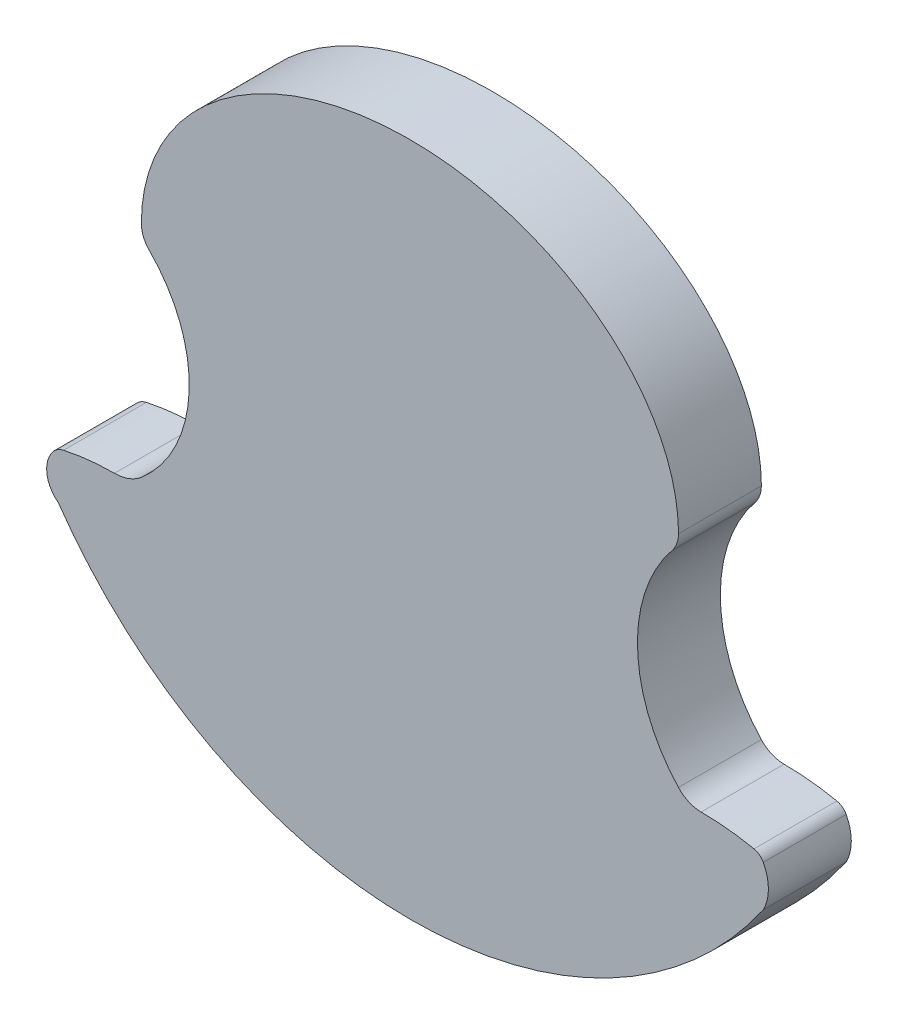
ISO-10303-21;
HEADER;
FILE_DESCRIPTION(('STEP AP214'),'2;1');
FILE_NAME('part.step','',(''),(''),'','','');
FILE_SCHEMA(('AUTOMOTIVE_DESIGN { 1 0 10303 214 1 1 1 1 }'));
ENDSEC;
DATA;
#1=APPLICATION_CONTEXT('core data for automotive mechanical design processes');
#2=APPLICATION_PROTOCOL_DEFINITION('international standard','automotive_design',2000,#1);
#3=PRODUCT_CONTEXT('',#1,'mechanical');
#4=PRODUCT('Part','Part','',(#3));
#5=PRODUCT_RELATED_PRODUCT_CATEGORY('part','',(#4));
#6=PRODUCT_DEFINITION_FORMATION('','',#4);
#7=PRODUCT_DEFINITION_CONTEXT('part definition',#1,'design');
#8=PRODUCT_DEFINITION('design','',#6,#7);
#9=PRODUCT_DEFINITION_SHAPE('','',#8);
#10=(LENGTH_UNIT() NAMED_UNIT(*) SI_UNIT(.MILLI.,.METRE.));
#11=(NAMED_UNIT(*) PLANE_ANGLE_UNIT() SI_UNIT($,.RADIAN.));
#12=(NAMED_UNIT(*) SI_UNIT($,.STERADIAN.) SOLID_ANGLE_UNIT());
#13=UNCERTAINTY_MEASURE_WITH_UNIT(LENGTH_MEASURE(1.E-05),#10,'distance_accuracy_value','');
#14=(GEOMETRIC_REPRESENTATION_CONTEXT(3) GLOBAL_UNCERTAINTY_ASSIGNED_CONTEXT((#13)) GLOBAL_UNIT_ASSIGNED_CONTEXT((#10,
#11,#12)) REPRESENTATION_CONTEXT('',''));
#15=CARTESIAN_POINT('',(0.,0.,0.));
#16=DIRECTION('',(0.,0.,1.));
#17=DIRECTION('',(1.,0.,0.));
#18=AXIS2_PLACEMENT_3D('',#15,#16,#17);
#19=CARTESIAN_POINT('',(-86.2074864245499,146.477908935832,20.));
#20=DIRECTION('',(0.,0.,-1.));
#21=DIRECTION('',(-1.,0.,0.));
#22=AXIS2_PLACEMENT_3D('',#19,#20,#21);
#23=CYLINDRICAL_SURFACE('',#22,32.9795025406708);
#24=CARTESIAN_POINT('',(-86.2074864245499,146.477908935832,0.));
#25=DIRECTION('',(0.,0.,1.));
#26=DIRECTION('',(1.,0.,0.));
#27=AXIS2_PLACEMENT_3D('',#24,#25,#26);
#28=CIRCLE('',#27,32.9795025406708);
#29=CARTESIAN_POINT('',(-62.8874565378825,169.7979388225,0.));
#30=VERTEX_POINT('',#29);
#31=CARTESIAN_POINT('',(-64.7925,121.397120585654,0.));
#32=VERTEX_POINT('',#31);
#33=EDGE_CURVE('E231',#30,#32,#28,.F.);
#34=ORIENTED_EDGE('',*,*,#33,.T.);
#35=DIRECTION('',(0.,0.,-1.));
#36=VECTOR('',#35,1.);
#37=CARTESIAN_POINT('',(-64.7925,121.397120585654,20.));
#38=LINE('',#37,#36);
#39=CARTESIAN_POINT('',(-64.7925,121.397120585654,20.));
#40=VERTEX_POINT('',#39);
#41=EDGE_CURVE('E11',#40,#32,#38,.T.);
#42=ORIENTED_EDGE('',*,*,#41,.F.);
#43=CARTESIAN_POINT('',(-86.2074864245499,146.477908935832,20.));
#44=DIRECTION('',(0.,0.,1.));
#45=DIRECTION('',(1.,0.,0.));
#46=AXIS2_PLACEMENT_3D('',#43,#44,#45);
#47=CIRCLE('',#46,32.9795025406708);
#48=CARTESIAN_POINT('',(-62.8874565378825,169.7979388225,20.));
#49=VERTEX_POINT('',#48);
#50=EDGE_CURVE('E268',#49,#40,#47,.F.);
#51=ORIENTED_EDGE('',*,*,#50,.F.);
#52=DIRECTION('',(0.,0.,-1.));
#53=VECTOR('',#52,1.);
#54=CARTESIAN_POINT('',(-62.8874565378825,169.7979388225,20.));
#55=LINE('',#54,#53);
#56=EDGE_CURVE('E168',#49,#30,#55,.T.);
#57=ORIENTED_EDGE('',*,*,#56,.T.);
#58=EDGE_LOOP('',(#34,#42,#51,#57));
#59=FACE_BOUND('',#58,.T.);
#60=ADVANCED_FACE('F41',(#59),#23,.F.);
#61=CARTESIAN_POINT('',(-71.2859231184699,129.002083186371,20.));
#62=DIRECTION('',(0.,0.,-1.));
#63=DIRECTION('',(-1.,0.,0.));
#64=AXIS2_PLACEMENT_3D('',#61,#62,#63);
#65=CYLINDRICAL_SURFACE('',#64,9.99999999768915);
#66=CARTESIAN_POINT('',(-71.2859231184699,129.002083186371,0.));
#67=DIRECTION('',(0.,0.,1.));
#68=DIRECTION('',(1.,0.,0.));
#69=AXIS2_PLACEMENT_3D('',#66,#67,#68);
#70=CIRCLE('',#69,9.99999999768915);
#71=CARTESIAN_POINT('',(-71.2859231188419,119.002083188681,0.));
#72=VERTEX_POINT('',#71);
#73=EDGE_CURVE('E222',#32,#72,#70,.F.);
#74=ORIENTED_EDGE('',*,*,#73,.T.);
#75=DIRECTION('',(0.,0.,-1.));
#76=VECTOR('',#75,1.);
#77=CARTESIAN_POINT('',(-71.2859231188419,119.002083188681,20.));
#78=LINE('',#77,#76);
#79=CARTESIAN_POINT('',(-71.2859231188419,119.002083188681,20.));
#80=VERTEX_POINT('',#79);
#81=EDGE_CURVE('E49',#80,#72,#78,.T.);
#82=ORIENTED_EDGE('',*,*,#81,.F.);
#83=CARTESIAN_POINT('',(-71.2859231184699,129.002083186371,20.));
#84=DIRECTION('',(0.,0.,1.));
#85=DIRECTION('',(1.,0.,0.));
#86=AXIS2_PLACEMENT_3D('',#83,#84,#85);
#87=CIRCLE('',#86,9.99999999768915);
#88=EDGE_CURVE('E114',#40,#80,#87,.F.);
#89=ORIENTED_EDGE('',*,*,#88,.F.);
#90=ORIENTED_EDGE('',*,*,#41,.T.);
#91=EDGE_LOOP('',(#74,#82,#89,#90));
#92=FACE_BOUND('',#91,.T.);
#93=ADVANCED_FACE('F215',(#92),#65,.F.);
#94=CARTESIAN_POINT('',(-71.2859231209852,61.3923220539593,20.));
#95=DIRECTION('',(0.,0.,-1.));
#96=DIRECTION('',(-1.,0.,0.));
#97=AXIS2_PLACEMENT_3D('',#94,#95,#96);
#98=CYLINDRICAL_SURFACE('',#97,57.6097611347222);
#99=CARTESIAN_POINT('',(-71.2859231209852,61.3923220539593,0.));
#100=DIRECTION('',(0.,0.,1.));
#101=DIRECTION('',(1.,0.,0.));
#102=AXIS2_PLACEMENT_3D('',#99,#100,#101);
#103=CIRCLE('',#102,57.6097611347222);
#104=CARTESIAN_POINT('',(-83.5684071675077,117.677534709209,0.));
#105=VERTEX_POINT('',#104);
#106=EDGE_CURVE('E230',#72,#105,#103,.T.);
#107=ORIENTED_EDGE('',*,*,#106,.T.);
#108=DIRECTION('',(0.,0.,-1.));
#109=VECTOR('',#108,1.);
#110=CARTESIAN_POINT('',(-83.5684071675077,117.677534709209,20.));
#111=LINE('',#110,#109);
#112=CARTESIAN_POINT('',(-83.5684071675077,117.677534709209,20.));
#113=VERTEX_POINT('',#112);
#114=EDGE_CURVE('E236',#113,#105,#111,.T.);
#115=ORIENTED_EDGE('',*,*,#114,.F.);
#116=CARTESIAN_POINT('',(-71.2859231209852,61.3923220539593,20.));
#117=DIRECTION('',(0.,0.,1.));
#118=DIRECTION('',(1.,0.,0.));
#119=AXIS2_PLACEMENT_3D('',#116,#117,#118);
#120=CIRCLE('',#119,57.6097611347222);
#121=EDGE_CURVE('E235',#80,#113,#120,.T.);
#122=ORIENTED_EDGE('',*,*,#121,.F.);
#123=ORIENTED_EDGE('',*,*,#81,.T.);
#124=EDGE_LOOP('',(#107,#115,#122,#123));
#125=FACE_BOUND('',#124,.T.);
#126=ADVANCED_FACE('F212',(#125),#98,.T.);
#127=CARTESIAN_POINT('',(-82.6075975240256,113.274567451139,20.));
#128=DIRECTION('',(0.,0.,-1.));
#129=DIRECTION('',(-1.,0.,0.));
#130=AXIS2_PLACEMENT_3D('',#127,#128,#129);
#131=CYLINDRICAL_SURFACE('',#130,4.50658139243527);
#132=CARTESIAN_POINT('',(-82.6075975240256,113.274567451139,0.));
#133=DIRECTION('',(0.,0.,1.));
#134=DIRECTION('',(1.,0.,0.));
#135=AXIS2_PLACEMENT_3D('',#132,#133,#134);
#136=CIRCLE('',#135,4.50658139243527);
#137=CARTESIAN_POINT('',(-86.2074864245499,115.985669763949,0.));
#138=VERTEX_POINT('',#137);
#139=EDGE_CURVE('E240',#105,#138,#136,.T.);
#140=ORIENTED_EDGE('',*,*,#139,.T.);
#141=DIRECTION('',(0.,0.,-1.));
#142=VECTOR('',#141,1.);
#143=CARTESIAN_POINT('',(-86.2074864245499,115.985669763949,20.));
#144=LINE('',#143,#142);
#145=CARTESIAN_POINT('',(-86.2074864245499,115.985669763949,20.));
#146=VERTEX_POINT('',#145);
#147=EDGE_CURVE('E285',#146,#138,#144,.T.);
#148=ORIENTED_EDGE('',*,*,#147,.F.);
#149=CARTESIAN_POINT('',(-82.6075975240256,113.274567451139,20.));
#150=DIRECTION('',(0.,0.,1.));
#151=DIRECTION('',(1.,0.,0.));
#152=AXIS2_PLACEMENT_3D('',#149,#150,#151);
#153=CIRCLE('',#152,4.50658139243527);
#154=EDGE_CURVE('E290',#113,#146,#153,.T.);
#155=ORIENTED_EDGE('',*,*,#154,.F.);
#156=ORIENTED_EDGE('',*,*,#114,.T.);
#157=EDGE_LOOP('',(#140,#148,#155,#156));
#158=FACE_BOUND('',#157,.T.);
#159=ADVANCED_FACE('F208',(#158),#131,.T.);
#160=CARTESIAN_POINT('',(-80.559563981391,111.732178608711,20.));
#161=DIRECTION('',(0.,0.,-1.));
#162=DIRECTION('',(-1.,0.,0.));
#163=AXIS2_PLACEMENT_3D('',#160,#161,#162);
#164=CYLINDRICAL_SURFACE('',#163,7.07044658643518);
#165=CARTESIAN_POINT('',(-80.559563981391,111.732178608711,0.));
#166=DIRECTION('',(0.,0.,1.));
#167=DIRECTION('',(1.,0.,0.));
#168=AXIS2_PLACEMENT_3D('',#165,#166,#167);
#169=CIRCLE('',#168,7.07044658643518);
#170=CARTESIAN_POINT('',(-84.8130551368997,106.084256165755,0.));
#171=VERTEX_POINT('',#170);
#172=EDGE_CURVE('E242',#138,#171,#169,.T.);
#173=ORIENTED_EDGE('',*,*,#172,.T.);
#174=DIRECTION('',(0.,0.,-1.));
#175=VECTOR('',#174,1.);
#176=CARTESIAN_POINT('',(-84.8130551368997,106.084256165755,20.));
#177=LINE('',#176,#175);
#178=CARTESIAN_POINT('',(-84.8130551368997,106.084256165755,20.));
#179=VERTEX_POINT('',#178);
#180=EDGE_CURVE('E282',#179,#171,#177,.T.);
#181=ORIENTED_EDGE('',*,*,#180,.F.);
#182=CARTESIAN_POINT('',(-80.559563981391,111.732178608711,20.));
#183=DIRECTION('',(0.,0.,1.));
#184=DIRECTION('',(1.,0.,0.));
#185=AXIS2_PLACEMENT_3D('',#182,#183,#184);
#186=CIRCLE('',#185,7.07044658643518);
#187=EDGE_CURVE('E292',#146,#179,#186,.T.);
#188=ORIENTED_EDGE('',*,*,#187,.F.);
#189=ORIENTED_EDGE('',*,*,#147,.T.);
#190=EDGE_LOOP('',(#173,#181,#188,#189));
#191=FACE_BOUND('',#190,.T.);
#192=ADVANCED_FACE('F204',(#191),#164,.T.);
#193=CARTESIAN_POINT('',(0.227166570778897,164.846079513863,20.));
#194=DIRECTION('',(0.,0.,-1.));
#195=DIRECTION('',(-1.,0.,0.));
#196=AXIS2_PLACEMENT_3D('',#193,#194,#195);
#197=CYLINDRICAL_SURFACE('',#196,103.367263634505);
#198=CARTESIAN_POINT('',(0.227166570778897,164.846079513863,0.));
#199=DIRECTION('',(0.,0.,1.));
#200=DIRECTION('',(1.,0.,0.));
#201=AXIS2_PLACEMENT_3D('',#198,#199,#200);
#202=CIRCLE('',#201,103.367263634505);
#203=CARTESIAN_POINT('',(85.267388278434,106.084256165721,0.));
#204=VERTEX_POINT('',#203);
#205=EDGE_CURVE('E246',#171,#204,#202,.T.);
#206=ORIENTED_EDGE('',*,*,#205,.T.);
#207=DIRECTION('',(0.,0.,-1.));
#208=VECTOR('',#207,1.);
#209=CARTESIAN_POINT('',(85.267388278434,106.084256165721,20.));
#210=LINE('',#209,#208);
#211=CARTESIAN_POINT('',(85.267388278434,106.084256165721,20.));
#212=VERTEX_POINT('',#211);
#213=EDGE_CURVE('E280',#212,#204,#210,.T.);
#214=ORIENTED_EDGE('',*,*,#213,.F.);
#215=CARTESIAN_POINT('',(0.227166570778897,164.846079513863,20.));
#216=DIRECTION('',(0.,0.,1.));
#217=DIRECTION('',(1.,0.,0.));
#218=AXIS2_PLACEMENT_3D('',#215,#216,#217);
#219=CIRCLE('',#218,103.367263634505);
#220=EDGE_CURVE('E294',#179,#212,#219,.T.);
#221=ORIENTED_EDGE('',*,*,#220,.F.);
#222=ORIENTED_EDGE('',*,*,#180,.T.);
#223=EDGE_LOOP('',(#206,#214,#221,#222));
#224=FACE_BOUND('',#223,.T.);
#225=ADVANCED_FACE('F200',(#224),#197,.T.);
#226=CARTESIAN_POINT('',(75.947420499303,111.034962965653,20.));
#227=DIRECTION('',(0.,0.,-1.));
#228=DIRECTION('',(-1.,0.,0.));
#229=AXIS2_PLACEMENT_3D('',#226,#227,#228);
#230=CYLINDRICAL_SURFACE('',#229,10.5532600282063);
#231=CARTESIAN_POINT('',(75.947420499303,111.034962965653,0.));
#232=DIRECTION('',(0.,0.,1.));
#233=DIRECTION('',(1.,0.,0.));
#234=AXIS2_PLACEMENT_3D('',#231,#232,#233);
#235=CIRCLE('',#234,10.5532600282063);
#236=CARTESIAN_POINT('',(85.2673882794041,115.985669763761,0.));
#237=VERTEX_POINT('',#236);
#238=EDGE_CURVE('E249',#237,#204,#235,.F.);
#239=ORIENTED_EDGE('',*,*,#238,.F.);
#240=DIRECTION('',(0.,0.,-1.));
#241=VECTOR('',#240,1.);
#242=CARTESIAN_POINT('',(85.2673882794041,115.985669763761,20.));
#243=LINE('',#242,#241);
#244=CARTESIAN_POINT('',(85.2673882794041,115.985669763761,20.));
#245=VERTEX_POINT('',#244);
#246=EDGE_CURVE('E278',#245,#237,#243,.T.);
#247=ORIENTED_EDGE('',*,*,#246,.F.);
#248=CARTESIAN_POINT('',(75.947420499303,111.034962965653,20.));
#249=DIRECTION('',(0.,0.,1.));
#250=DIRECTION('',(1.,0.,0.));
#251=AXIS2_PLACEMENT_3D('',#248,#249,#250);
#252=CIRCLE('',#251,10.5532600282063);
#253=EDGE_CURVE('E300',#245,#212,#252,.F.);
#254=ORIENTED_EDGE('',*,*,#253,.T.);
#255=ORIENTED_EDGE('',*,*,#213,.T.);
#256=EDGE_LOOP('',(#239,#247,#254,#255));
#257=FACE_BOUND('',#256,.T.);
#258=ADVANCED_FACE('F196',(#257),#230,.T.);
#259=CARTESIAN_POINT('',(82.3349840480645,114.427995541549,20.));
#260=DIRECTION('',(0.,0.,-1.));
#261=DIRECTION('',(-1.,0.,0.));
#262=AXIS2_PLACEMENT_3D('',#259,#260,#261);
#263=CYLINDRICAL_SURFACE('',#262,3.32044327741405);
#264=CARTESIAN_POINT('',(82.3349840480645,114.427995541549,0.));
#265=DIRECTION('',(0.,0.,1.));
#266=DIRECTION('',(1.,0.,0.));
#267=AXIS2_PLACEMENT_3D('',#264,#265,#266);
#268=CIRCLE('',#267,3.32044327741405);
#269=CARTESIAN_POINT('',(83.0175078631906,117.677534708925,0.));
#270=VERTEX_POINT('',#269);
#271=EDGE_CURVE('E252',#270,#237,#268,.F.);
#272=ORIENTED_EDGE('',*,*,#271,.F.);
#273=DIRECTION('',(0.,0.,-1.));
#274=VECTOR('',#273,1.);
#275=CARTESIAN_POINT('',(83.0175078631906,117.677534708925,20.));
#276=LINE('',#275,#274);
#277=CARTESIAN_POINT('',(83.0175078631906,117.677534708925,20.));
#278=VERTEX_POINT('',#277);
#279=EDGE_CURVE('E276',#278,#270,#276,.T.);
#280=ORIENTED_EDGE('',*,*,#279,.F.);
#281=CARTESIAN_POINT('',(82.3349840480645,114.427995541549,20.));
#282=DIRECTION('',(0.,0.,1.));
#283=DIRECTION('',(1.,0.,0.));
#284=AXIS2_PLACEMENT_3D('',#281,#282,#283);
#285=CIRCLE('',#284,3.32044327741405);
#286=EDGE_CURVE('E303',#278,#245,#285,.F.);
#287=ORIENTED_EDGE('',*,*,#286,.T.);
#288=ORIENTED_EDGE('',*,*,#246,.T.);
#289=EDGE_LOOP('',(#272,#280,#287,#288));
#290=FACE_BOUND('',#289,.T.);
#291=ADVANCED_FACE('F192',(#290),#263,.T.);
#292=CARTESIAN_POINT('',(70.2673882786838,56.9734067939054,20.));
#293=DIRECTION('',(0.,0.,-1.));
#294=DIRECTION('',(-1.,0.,0.));
#295=AXIS2_PLACEMENT_3D('',#292,#293,#294);
#296=CYLINDRICAL_SURFACE('',#295,62.0286763952152);
#297=CARTESIAN_POINT('',(70.2673882786838,56.9734067939054,0.));
#298=DIRECTION('',(0.,0.,1.));
#299=DIRECTION('',(1.,0.,0.));
#300=AXIS2_PLACEMENT_3D('',#297,#298,#299);
#301=CIRCLE('',#300,62.0286763952152);
#302=CARTESIAN_POINT('',(70.2673882789058,119.00208318912,0.));
#303=VERTEX_POINT('',#302);
#304=EDGE_CURVE('E255',#303,#270,#301,.F.);
#305=ORIENTED_EDGE('',*,*,#304,.F.);
#306=DIRECTION('',(0.,0.,-1.));
#307=VECTOR('',#306,1.);
#308=CARTESIAN_POINT('',(70.2673882789058,119.00208318912,20.));
#309=LINE('',#308,#307);
#310=CARTESIAN_POINT('',(70.2673882789058,119.00208318912,20.));
#311=VERTEX_POINT('',#310);
#312=EDGE_CURVE('E274',#311,#303,#309,.T.);
#313=ORIENTED_EDGE('',*,*,#312,.F.);
#314=CARTESIAN_POINT('',(70.2673882786838,56.9734067939054,20.));
#315=DIRECTION('',(0.,0.,1.));
#316=DIRECTION('',(1.,0.,0.));
#317=AXIS2_PLACEMENT_3D('',#314,#315,#316);
#318=CIRCLE('',#317,62.0286763952152);
#319=EDGE_CURVE('E306',#311,#278,#318,.F.);
#320=ORIENTED_EDGE('',*,*,#319,.T.);
#321=ORIENTED_EDGE('',*,*,#279,.T.);
#322=EDGE_LOOP('',(#305,#313,#320,#321));
#323=FACE_BOUND('',#322,.T.);
#324=ADVANCED_FACE('F188',(#323),#296,.T.);
#325=CARTESIAN_POINT('',(70.2673882789328,126.457208075541,20.));
#326=DIRECTION('',(0.,0.,-1.));
#327=DIRECTION('',(-1.,0.,0.));
#328=AXIS2_PLACEMENT_3D('',#325,#326,#327);
#329=CYLINDRICAL_SURFACE('',#328,7.45512488642018);
#330=CARTESIAN_POINT('',(70.2673882789328,126.457208075541,0.));
#331=DIRECTION('',(0.,0.,1.));
#332=DIRECTION('',(1.,0.,0.));
#333=AXIS2_PLACEMENT_3D('',#330,#331,#332);
#334=CIRCLE('',#333,7.45512488642018);
#335=CARTESIAN_POINT('',(64.7924999999895,121.397120585663,0.));
#336=VERTEX_POINT('',#335);
#337=EDGE_CURVE('E258',#336,#303,#334,.T.);
#338=ORIENTED_EDGE('',*,*,#337,.F.);
#339=DIRECTION('',(0.,0.,-1.));
#340=VECTOR('',#339,1.);
#341=CARTESIAN_POINT('',(64.7924999999895,121.397120585663,20.));
#342=LINE('',#341,#340);
#343=CARTESIAN_POINT('',(64.7924999999895,121.397120585663,20.));
#344=VERTEX_POINT('',#343);
#345=EDGE_CURVE('E272',#344,#336,#342,.T.);
#346=ORIENTED_EDGE('',*,*,#345,.F.);
#347=CARTESIAN_POINT('',(70.2673882789328,126.457208075541,20.));
#348=DIRECTION('',(0.,0.,1.));
#349=DIRECTION('',(1.,0.,0.));
#350=AXIS2_PLACEMENT_3D('',#347,#348,#349);
#351=CIRCLE('',#350,7.45512488642018);
#352=EDGE_CURVE('E309',#344,#311,#351,.T.);
#353=ORIENTED_EDGE('',*,*,#352,.T.);
#354=ORIENTED_EDGE('',*,*,#312,.T.);
#355=EDGE_LOOP('',(#338,#346,#353,#354));
#356=FACE_BOUND('',#355,.T.);
#357=ADVANCED_FACE('F184',(#356),#329,.F.);
#358=CARTESIAN_POINT('',(92.1250980180888,146.658884890366,20.));
#359=DIRECTION('',(0.,0.,-1.));
#360=DIRECTION('',(-1.,0.,0.));
#361=AXIS2_PLACEMENT_3D('',#358,#359,#360);
#362=CYLINDRICAL_SURFACE('',#361,37.218646539139);
#363=CARTESIAN_POINT('',(92.1250980180888,146.658884890366,0.));
#364=DIRECTION('',(0.,0.,1.));
#365=DIRECTION('',(1.,0.,0.));
#366=AXIS2_PLACEMENT_3D('',#363,#364,#365);
#367=CIRCLE('',#366,37.218646539139);
#368=CARTESIAN_POINT('',(63.2961235597048,170.198593509701,0.));
#369=VERTEX_POINT('',#368);
#370=EDGE_CURVE('E261',#369,#336,#367,.T.);
#371=ORIENTED_EDGE('',*,*,#370,.F.);
#372=DIRECTION('',(0.,0.,-1.));
#373=VECTOR('',#372,1.);
#374=CARTESIAN_POINT('',(63.2961235597048,170.198593509701,20.));
#375=LINE('',#374,#373);
#376=CARTESIAN_POINT('',(63.2961235597048,170.198593509701,20.));
#377=VERTEX_POINT('',#376);
#378=EDGE_CURVE('E157',#377,#369,#375,.T.);
#379=ORIENTED_EDGE('',*,*,#378,.F.);
#380=CARTESIAN_POINT('',(92.1250980180888,146.658884890366,20.));
#381=DIRECTION('',(0.,0.,1.));
#382=DIRECTION('',(1.,0.,0.));
#383=AXIS2_PLACEMENT_3D('',#380,#381,#382);
#384=CIRCLE('',#383,37.218646539139);
#385=EDGE_CURVE('E164',#377,#344,#384,.T.);
#386=ORIENTED_EDGE('',*,*,#385,.T.);
#387=ORIENTED_EDGE('',*,*,#345,.T.);
#388=EDGE_LOOP('',(#371,#379,#386,#387));
#389=FACE_BOUND('',#388,.T.);
#390=ADVANCED_FACE('F181',(#389),#362,.F.);
#391=CARTESIAN_POINT('',(58.154206478541,174.397120585651,20.));
#392=DIRECTION('',(0.,0.,-1.));
#393=DIRECTION('',(-1.,0.,0.));
#394=AXIS2_PLACEMENT_3D('',#391,#392,#393);
#395=CYLINDRICAL_SURFACE('',#394,6.63829352145898);
#396=CARTESIAN_POINT('',(58.154206478541,174.397120585651,0.));
#397=DIRECTION('',(0.,0.,1.));
#398=DIRECTION('',(1.,0.,0.));
#399=AXIS2_PLACEMENT_3D('',#396,#397,#398);
#400=CIRCLE('',#399,6.63829352145898);
#401=CARTESIAN_POINT('',(64.7924999999999,174.397120585651,0.));
#402=VERTEX_POINT('',#401);
#403=EDGE_CURVE('E152',#402,#369,#400,.F.);
#404=ORIENTED_EDGE('',*,*,#403,.F.);
#405=DIRECTION('',(0.,0.,-1.));
#406=VECTOR('',#405,1.);
#407=CARTESIAN_POINT('',(64.7924999999999,174.397120585651,20.));
#408=LINE('',#407,#406);
#409=CARTESIAN_POINT('',(64.7924999999999,174.397120585651,20.));
#410=VERTEX_POINT('',#409);
#411=EDGE_CURVE('E147',#410,#402,#408,.T.);
#412=ORIENTED_EDGE('',*,*,#411,.F.);
#413=CARTESIAN_POINT('',(58.154206478541,174.397120585651,20.));
#414=DIRECTION('',(0.,0.,1.));
#415=DIRECTION('',(1.,0.,0.));
#416=AXIS2_PLACEMENT_3D('',#413,#414,#415);
#417=CIRCLE('',#416,6.63829352145898);
#418=EDGE_CURVE('E150',#410,#377,#417,.F.);
#419=ORIENTED_EDGE('',*,*,#418,.T.);
#420=ORIENTED_EDGE('',*,*,#378,.T.);
#421=EDGE_LOOP('',(#404,#412,#419,#420));
#422=FACE_BOUND('',#421,.T.);
#423=ADVANCED_FACE('F149',(#422),#395,.T.);
#424=CARTESIAN_POINT('',(0.,174.397120585654,20.));
#425=DIRECTION('',(0.,0.,-1.));
#426=DIRECTION('',(1.,0.,0.));
#427=AXIS2_PLACEMENT_3D('',#424,#425,#426);
#428=ELLIPSE('',#427,64.7925,50.);
#429=DIRECTION('',(0.,0.,-1.));
#430=VECTOR('',#429,1.);
#431=SURFACE_OF_LINEAR_EXTRUSION('',#428,#430);
#432=CARTESIAN_POINT('',(0.,174.397120585654,0.));
#433=DIRECTION('',(0.,0.,-1.));
#434=DIRECTION('',(1.,0.,0.));
#435=AXIS2_PLACEMENT_3D('',#432,#433,#434);
#436=ELLIPSE('',#435,64.7925,50.);
#437=CARTESIAN_POINT('',(-64.7925,174.397120585654,0.));
#438=VERTEX_POINT('',#437);
#439=EDGE_CURVE('E265',#438,#402,#436,.T.);
#440=ORIENTED_EDGE('',*,*,#439,.F.);
#441=DIRECTION('',(0.,0.,-1.));
#442=VECTOR('',#441,1.);
#443=CARTESIAN_POINT('',(-64.7925,174.397120585654,20.));
#444=LINE('',#443,#442);
#445=CARTESIAN_POINT('',(-64.7925,174.397120585654,20.));
#446=VERTEX_POINT('',#445);
#447=EDGE_CURVE('E103',#446,#438,#444,.T.);
#448=ORIENTED_EDGE('',*,*,#447,.F.);
#449=EDGE_CURVE('E161',#446,#410,#428,.T.);
#450=ORIENTED_EDGE('',*,*,#449,.T.);
#451=ORIENTED_EDGE('',*,*,#411,.T.);
#452=EDGE_LOOP('',(#440,#448,#450,#451));
#453=FACE_BOUND('',#452,.T.);
#454=ADVANCED_FACE('F166',(#453),#431,.T.);
#455=CARTESIAN_POINT('',(-58.2882747747284,174.397120585654,20.));
#456=DIRECTION('',(0.,0.,-1.));
#457=DIRECTION('',(-1.,0.,0.));
#458=AXIS2_PLACEMENT_3D('',#455,#456,#457);
#459=CYLINDRICAL_SURFACE('',#458,6.50422522527158);
#460=CARTESIAN_POINT('',(-58.2882747747284,174.397120585654,0.));
#461=DIRECTION('',(0.,0.,1.));
#462=DIRECTION('',(1.,0.,0.));
#463=AXIS2_PLACEMENT_3D('',#460,#461,#462);
#464=CIRCLE('',#463,6.50422522527158);
#465=EDGE_CURVE('E106',#438,#30,#464,.T.);
#466=ORIENTED_EDGE('',*,*,#465,.T.);
#467=ORIENTED_EDGE('',*,*,#56,.F.);
#468=CARTESIAN_POINT('',(-58.2882747747284,174.397120585654,20.));
#469=DIRECTION('',(0.,0.,1.));
#470=DIRECTION('',(1.,0.,0.));
#471=AXIS2_PLACEMENT_3D('',#468,#469,#470);
#472=CIRCLE('',#471,6.50422522527158);
#473=EDGE_CURVE('E57',#446,#49,#472,.T.);
#474=ORIENTED_EDGE('',*,*,#473,.F.);
#475=ORIENTED_EDGE('',*,*,#447,.T.);
#476=EDGE_LOOP('',(#466,#467,#474,#475));
#477=FACE_BOUND('',#476,.T.);
#478=ADVANCED_FACE('F177',(#477),#459,.T.);
#479=CARTESIAN_POINT('',(0.,0.,20.));
#480=DIRECTION('',(0.,0.,1.));
#481=DIRECTION('',(1.,0.,0.));
#482=AXIS2_PLACEMENT_3D('',#479,#480,#481);
#483=PLANE('',#482);
#484=ORIENTED_EDGE('',*,*,#50,.T.);
#485=ORIENTED_EDGE('',*,*,#88,.T.);
#486=ORIENTED_EDGE('',*,*,#121,.T.);
#487=ORIENTED_EDGE('',*,*,#154,.T.);
#488=ORIENTED_EDGE('',*,*,#187,.T.);
#489=ORIENTED_EDGE('',*,*,#220,.T.);
#490=ORIENTED_EDGE('',*,*,#253,.F.);
#491=ORIENTED_EDGE('',*,*,#286,.F.);
#492=ORIENTED_EDGE('',*,*,#319,.F.);
#493=ORIENTED_EDGE('',*,*,#352,.F.);
#494=ORIENTED_EDGE('',*,*,#385,.F.);
#495=ORIENTED_EDGE('',*,*,#418,.F.);
#496=ORIENTED_EDGE('',*,*,#449,.F.);
#497=ORIENTED_EDGE('',*,*,#473,.T.);
#498=EDGE_LOOP('',(#484,#485,#486,#487,#488,#489,#490,#491,#492,#493,#494,#495,#496,#497));
#499=FACE_BOUND('',#498,.T.);
#500=ADVANCED_FACE('F160',(#499),#483,.T.);
#501=CARTESIAN_POINT('',(0.,0.,0.));
#502=DIRECTION('',(0.,0.,1.));
#503=DIRECTION('',(1.,0.,0.));
#504=AXIS2_PLACEMENT_3D('',#501,#502,#503);
#505=PLANE('',#504);
#506=ORIENTED_EDGE('',*,*,#33,.F.);
#507=ORIENTED_EDGE('',*,*,#465,.F.);
#508=ORIENTED_EDGE('',*,*,#439,.T.);
#509=ORIENTED_EDGE('',*,*,#403,.T.);
#510=ORIENTED_EDGE('',*,*,#370,.T.);
#511=ORIENTED_EDGE('',*,*,#337,.T.);
#512=ORIENTED_EDGE('',*,*,#304,.T.);
#513=ORIENTED_EDGE('',*,*,#271,.T.);
#514=ORIENTED_EDGE('',*,*,#238,.T.);
#515=ORIENTED_EDGE('',*,*,#205,.F.);
#516=ORIENTED_EDGE('',*,*,#172,.F.);
#517=ORIENTED_EDGE('',*,*,#139,.F.);
#518=ORIENTED_EDGE('',*,*,#106,.F.);
#519=ORIENTED_EDGE('',*,*,#73,.F.);
#520=EDGE_LOOP('',(#506,#507,#508,#509,#510,#511,#512,#513,#514,#515,#516,#517,#518,#519));
#521=FACE_BOUND('',#520,.T.);
#522=ADVANCED_FACE('F238',(#521),#505,.F.);
#523=CLOSED_SHELL('',(#60,#93,#126,#159,#192,#225,#258,#291,#324,#357,#390,#423,#454,#478,#500,#522));
#524=MANIFOLD_SOLID_BREP('B2',#523);
#525=ADVANCED_BREP_SHAPE_REPRESENTATION('',(#18,#524),#14);
#526=SHAPE_DEFINITION_REPRESENTATION(#9,#525);
ENDSEC;
END-ISO-10303-21;
